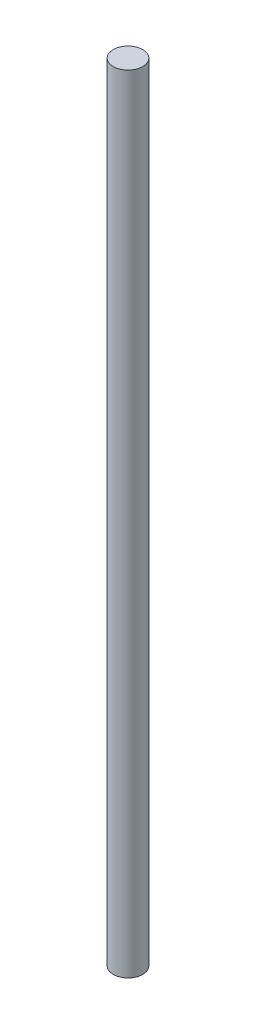
ISO-10303-21;
HEADER;
FILE_DESCRIPTION(('STEP AP214'),'2;1');
FILE_NAME('part.step','',(''),(''),'','','');
FILE_SCHEMA(('AUTOMOTIVE_DESIGN { 1 0 10303 214 1 1 1 1 }'));
ENDSEC;
DATA;
#1=APPLICATION_CONTEXT('core data for automotive mechanical design processes');
#2=APPLICATION_PROTOCOL_DEFINITION('international standard','automotive_design',2000,#1);
#3=PRODUCT_CONTEXT('',#1,'mechanical');
#4=PRODUCT('Part','Part','',(#3));
#5=PRODUCT_RELATED_PRODUCT_CATEGORY('part','',(#4));
#6=PRODUCT_DEFINITION_FORMATION('','',#4);
#7=PRODUCT_DEFINITION_CONTEXT('part definition',#1,'design');
#8=PRODUCT_DEFINITION('design','',#6,#7);
#9=PRODUCT_DEFINITION_SHAPE('','',#8);
#10=(LENGTH_UNIT() NAMED_UNIT(*) SI_UNIT(.MILLI.,.METRE.));
#11=(NAMED_UNIT(*) PLANE_ANGLE_UNIT() SI_UNIT($,.RADIAN.));
#12=(NAMED_UNIT(*) SI_UNIT($,.STERADIAN.) SOLID_ANGLE_UNIT());
#13=UNCERTAINTY_MEASURE_WITH_UNIT(LENGTH_MEASURE(1.E-05),#10,'distance_accuracy_value','');
#14=(GEOMETRIC_REPRESENTATION_CONTEXT(3) GLOBAL_UNCERTAINTY_ASSIGNED_CONTEXT((#13)) GLOBAL_UNIT_ASSIGNED_CONTEXT((#10,
#11,#12)) REPRESENTATION_CONTEXT('',''));
#15=CARTESIAN_POINT('',(0.,0.,0.));
#16=DIRECTION('',(0.,0.,1.));
#17=DIRECTION('',(1.,0.,0.));
#18=AXIS2_PLACEMENT_3D('',#15,#16,#17);
#19=CARTESIAN_POINT('',(0.,40.,0.));
#20=DIRECTION('',(0.,-1.,0.));
#21=DIRECTION('',(0.,0.,-1.));
#22=AXIS2_PLACEMENT_3D('',#19,#20,#21);
#23=CYLINDRICAL_SURFACE('',#22,1.5);
#24=CARTESIAN_POINT('',(0.,40.,0.));
#25=DIRECTION('',(0.,1.,0.));
#26=DIRECTION('',(0.,0.,1.));
#27=AXIS2_PLACEMENT_3D('',#24,#25,#26);
#28=CIRCLE('',#27,1.5);
#29=CARTESIAN_POINT('',(0.,40.,1.5));
#30=VERTEX_POINT('',#29);
#31=EDGE_CURVE('E10',#30,#30,#28,.T.);
#32=ORIENTED_EDGE('',*,*,#31,.F.);
#33=EDGE_LOOP('',(#32));
#34=FACE_BOUND('',#33,.T.);
#35=CARTESIAN_POINT('',(0.,-40.,0.));
#36=DIRECTION('',(0.,1.,0.));
#37=DIRECTION('',(0.,0.,1.));
#38=AXIS2_PLACEMENT_3D('',#35,#36,#37);
#39=CIRCLE('',#38,1.5);
#40=CARTESIAN_POINT('',(0.,-40.,1.5));
#41=VERTEX_POINT('',#40);
#42=EDGE_CURVE('E38',#41,#41,#39,.T.);
#43=ORIENTED_EDGE('',*,*,#42,.T.);
#44=EDGE_LOOP('',(#43));
#45=FACE_BOUND('',#44,.T.);
#46=ADVANCED_FACE('F35',(#34,#45),#23,.T.);
#47=CARTESIAN_POINT('',(0.,40.,0.));
#48=DIRECTION('',(0.,1.,0.));
#49=DIRECTION('',(0.,0.,1.));
#50=AXIS2_PLACEMENT_3D('',#47,#48,#49);
#51=PLANE('',#50);
#52=ORIENTED_EDGE('',*,*,#31,.T.);
#53=EDGE_LOOP('',(#52));
#54=FACE_BOUND('',#53,.T.);
#55=ADVANCED_FACE('F50',(#54),#51,.T.);
#56=CARTESIAN_POINT('',(0.,-40.,0.));
#57=DIRECTION('',(0.,1.,0.));
#58=DIRECTION('',(0.,0.,1.));
#59=AXIS2_PLACEMENT_3D('',#56,#57,#58);
#60=PLANE('',#59);
#61=ORIENTED_EDGE('',*,*,#42,.F.);
#62=EDGE_LOOP('',(#61));
#63=FACE_BOUND('',#62,.T.);
#64=ADVANCED_FACE('F48',(#63),#60,.F.);
#65=CLOSED_SHELL('',(#46,#55,#64));
#66=MANIFOLD_SOLID_BREP('B2',#65);
#67=ADVANCED_BREP_SHAPE_REPRESENTATION('',(#18,#66),#14);
#68=SHAPE_DEFINITION_REPRESENTATION(#9,#67);
ENDSEC;
END-ISO-10303-21;
